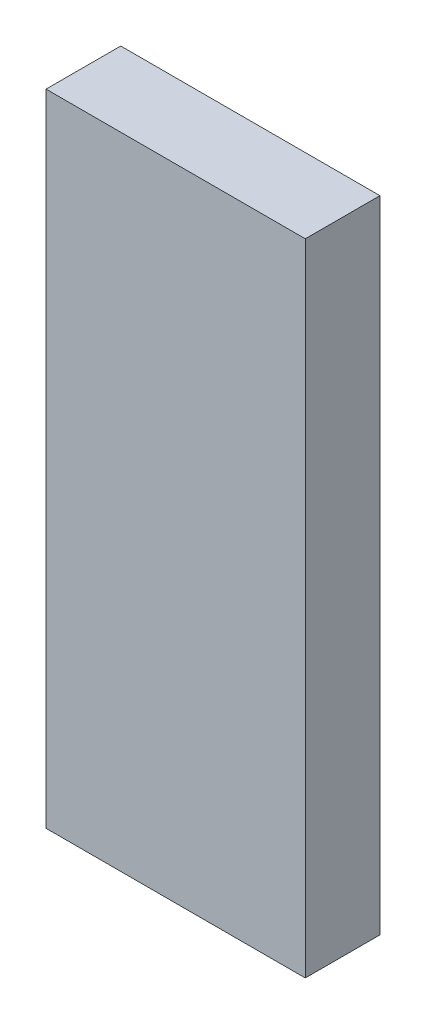
ISO-10303-21;
HEADER;
FILE_DESCRIPTION(('STEP AP214'),'2;1');
FILE_NAME('part.step','',(''),(''),'','','');
FILE_SCHEMA(('AUTOMOTIVE_DESIGN { 1 0 10303 214 1 1 1 1 }'));
ENDSEC;
DATA;
#1=APPLICATION_CONTEXT('core data for automotive mechanical design processes');
#2=APPLICATION_PROTOCOL_DEFINITION('international standard','automotive_design',2000,#1);
#3=PRODUCT_CONTEXT('',#1,'mechanical');
#4=PRODUCT('Part','Part','',(#3));
#5=PRODUCT_RELATED_PRODUCT_CATEGORY('part','',(#4));
#6=PRODUCT_DEFINITION_FORMATION('','',#4);
#7=PRODUCT_DEFINITION_CONTEXT('part definition',#1,'design');
#8=PRODUCT_DEFINITION('design','',#6,#7);
#9=PRODUCT_DEFINITION_SHAPE('','',#8);
#10=(LENGTH_UNIT() NAMED_UNIT(*) SI_UNIT(.MILLI.,.METRE.));
#11=(NAMED_UNIT(*) PLANE_ANGLE_UNIT() SI_UNIT($,.RADIAN.));
#12=(NAMED_UNIT(*) SI_UNIT($,.STERADIAN.) SOLID_ANGLE_UNIT());
#13=UNCERTAINTY_MEASURE_WITH_UNIT(LENGTH_MEASURE(1.E-05),#10,'distance_accuracy_value','');
#14=(GEOMETRIC_REPRESENTATION_CONTEXT(3) GLOBAL_UNCERTAINTY_ASSIGNED_CONTEXT((#13)) GLOBAL_UNIT_ASSIGNED_CONTEXT((#10,
#11,#12)) REPRESENTATION_CONTEXT('',''));
#15=CARTESIAN_POINT('',(0.,0.,0.));
#16=DIRECTION('',(0.,0.,1.));
#17=DIRECTION('',(1.,0.,0.));
#18=AXIS2_PLACEMENT_3D('',#15,#16,#17);
#19=CARTESIAN_POINT('',(0.62500002,1.5434945,0.35999928));
#20=DIRECTION('',(0.,0.,1.));
#21=DIRECTION('',(1.,0.,0.));
#22=AXIS2_PLACEMENT_3D('',#19,#20,#21);
#23=PLANE('',#22);
#24=DIRECTION('',(1.,0.,0.));
#25=VECTOR('',#24,1.);
#26=CARTESIAN_POINT('',(-0.62500002,1.5434945,0.35999928));
#27=LINE('',#26,#25);
#28=CARTESIAN_POINT('',(-0.62500002,1.5434945,0.35999928));
#29=VERTEX_POINT('',#28);
#30=CARTESIAN_POINT('',(0.62500002,1.5434945,0.35999928));
#31=VERTEX_POINT('',#30);
#32=EDGE_CURVE('E27',#29,#31,#27,.T.);
#33=ORIENTED_EDGE('',*,*,#32,.F.);
#34=DIRECTION('',(0.,1.,0.));
#35=VECTOR('',#34,1.);
#36=CARTESIAN_POINT('',(-0.62500002,-1.54349196,0.35999928));
#37=LINE('',#36,#35);
#38=CARTESIAN_POINT('',(-0.62500002,-1.54349196,0.35999928));
#39=VERTEX_POINT('',#38);
#40=EDGE_CURVE('E97',#39,#29,#37,.T.);
#41=ORIENTED_EDGE('',*,*,#40,.F.);
#42=DIRECTION('',(-1.,0.,0.));
#43=VECTOR('',#42,1.);
#44=CARTESIAN_POINT('',(0.62500002,-1.54349196,0.35999928));
#45=LINE('',#44,#43);
#46=CARTESIAN_POINT('',(0.62500002,-1.54349196,0.35999928));
#47=VERTEX_POINT('',#46);
#48=EDGE_CURVE('E20',#47,#39,#45,.T.);
#49=ORIENTED_EDGE('',*,*,#48,.F.);
#50=DIRECTION('',(0.,-1.,0.));
#51=VECTOR('',#50,1.);
#52=CARTESIAN_POINT('',(0.62500002,1.5434945,0.35999928));
#53=LINE('',#52,#51);
#54=EDGE_CURVE('E81',#31,#47,#53,.T.);
#55=ORIENTED_EDGE('',*,*,#54,.F.);
#56=EDGE_LOOP('',(#33,#41,#49,#55));
#57=FACE_BOUND('',#56,.T.);
#58=ADVANCED_FACE('F16',(#57),#23,.T.);
#59=CARTESIAN_POINT('',(0.62500002,1.5434945,0.));
#60=DIRECTION('',(0.,0.,1.));
#61=DIRECTION('',(1.,0.,0.));
#62=AXIS2_PLACEMENT_3D('',#59,#60,#61);
#63=PLANE('',#62);
#64=DIRECTION('',(0.,-1.,0.));
#65=VECTOR('',#64,1.);
#66=CARTESIAN_POINT('',(0.62500002,1.5434945,0.));
#67=LINE('',#66,#65);
#68=CARTESIAN_POINT('',(0.62500002,1.5434945,0.));
#69=VERTEX_POINT('',#68);
#70=CARTESIAN_POINT('',(0.62500002,-1.54349196,0.));
#71=VERTEX_POINT('',#70);
#72=EDGE_CURVE('E89',#69,#71,#67,.T.);
#73=ORIENTED_EDGE('',*,*,#72,.T.);
#74=DIRECTION('',(-1.,0.,0.));
#75=VECTOR('',#74,1.);
#76=CARTESIAN_POINT('',(0.62500002,-1.54349196,0.));
#77=LINE('',#76,#75);
#78=CARTESIAN_POINT('',(-0.62500002,-1.54349196,0.));
#79=VERTEX_POINT('',#78);
#80=EDGE_CURVE('E100',#71,#79,#77,.T.);
#81=ORIENTED_EDGE('',*,*,#80,.T.);
#82=DIRECTION('',(0.,1.,0.));
#83=VECTOR('',#82,1.);
#84=CARTESIAN_POINT('',(-0.62500002,-1.54349196,0.));
#85=LINE('',#84,#83);
#86=CARTESIAN_POINT('',(-0.62500002,1.5434945,0.));
#87=VERTEX_POINT('',#86);
#88=EDGE_CURVE('E78',#79,#87,#85,.T.);
#89=ORIENTED_EDGE('',*,*,#88,.T.);
#90=DIRECTION('',(1.,0.,0.));
#91=VECTOR('',#90,1.);
#92=CARTESIAN_POINT('',(-0.62500002,1.5434945,0.));
#93=LINE('',#92,#91);
#94=EDGE_CURVE('E10',#87,#69,#93,.T.);
#95=ORIENTED_EDGE('',*,*,#94,.T.);
#96=EDGE_LOOP('',(#73,#81,#89,#95));
#97=FACE_BOUND('',#96,.T.);
#98=ADVANCED_FACE('F115',(#97),#63,.F.);
#99=CARTESIAN_POINT('',(-0.62500002,1.5434945,0.));
#100=DIRECTION('',(0.,1.,0.));
#101=DIRECTION('',(1.,0.,0.));
#102=AXIS2_PLACEMENT_3D('',#99,#100,#101);
#103=PLANE('',#102);
#104=DIRECTION('',(0.,0.,1.));
#105=VECTOR('',#104,1.);
#106=CARTESIAN_POINT('',(-0.62500002,1.5434945,0.));
#107=LINE('',#106,#105);
#108=EDGE_CURVE('E74',#87,#29,#107,.T.);
#109=ORIENTED_EDGE('',*,*,#108,.T.);
#110=ORIENTED_EDGE('',*,*,#32,.T.);
#111=DIRECTION('',(0.,0.,1.));
#112=VECTOR('',#111,1.);
#113=CARTESIAN_POINT('',(0.62500002,1.5434945,0.));
#114=LINE('',#113,#112);
#115=EDGE_CURVE('E72',#69,#31,#114,.T.);
#116=ORIENTED_EDGE('',*,*,#115,.F.);
#117=ORIENTED_EDGE('',*,*,#94,.F.);
#118=EDGE_LOOP('',(#109,#110,#116,#117));
#119=FACE_BOUND('',#118,.T.);
#120=ADVANCED_FACE('F70',(#119),#103,.T.);
#121=CARTESIAN_POINT('',(-0.62500002,-1.54349196,0.));
#122=DIRECTION('',(-1.,0.,0.));
#123=DIRECTION('',(0.,0.,1.));
#124=AXIS2_PLACEMENT_3D('',#121,#122,#123);
#125=PLANE('',#124);
#126=DIRECTION('',(0.,0.,1.));
#127=VECTOR('',#126,1.);
#128=CARTESIAN_POINT('',(-0.62500002,-1.54349196,0.));
#129=LINE('',#128,#127);
#130=EDGE_CURVE('E104',#79,#39,#129,.T.);
#131=ORIENTED_EDGE('',*,*,#130,.T.);
#132=ORIENTED_EDGE('',*,*,#40,.T.);
#133=ORIENTED_EDGE('',*,*,#108,.F.);
#134=ORIENTED_EDGE('',*,*,#88,.F.);
#135=EDGE_LOOP('',(#131,#132,#133,#134));
#136=FACE_BOUND('',#135,.T.);
#137=ADVANCED_FACE('F118',(#136),#125,.T.);
#138=CARTESIAN_POINT('',(0.62500002,-1.54349196,0.));
#139=DIRECTION('',(0.,-1.,0.));
#140=DIRECTION('',(0.,0.,-1.));
#141=AXIS2_PLACEMENT_3D('',#138,#139,#140);
#142=PLANE('',#141);
#143=DIRECTION('',(0.,0.,1.));
#144=VECTOR('',#143,1.);
#145=CARTESIAN_POINT('',(0.62500002,-1.54349196,0.));
#146=LINE('',#145,#144);
#147=EDGE_CURVE('E87',#71,#47,#146,.T.);
#148=ORIENTED_EDGE('',*,*,#147,.T.);
#149=ORIENTED_EDGE('',*,*,#48,.T.);
#150=ORIENTED_EDGE('',*,*,#130,.F.);
#151=ORIENTED_EDGE('',*,*,#80,.F.);
#152=EDGE_LOOP('',(#148,#149,#150,#151));
#153=FACE_BOUND('',#152,.T.);
#154=ADVANCED_FACE('F120',(#153),#142,.T.);
#155=CARTESIAN_POINT('',(0.62500002,1.5434945,0.));
#156=DIRECTION('',(1.,0.,0.));
#157=DIRECTION('',(0.,1.,0.));
#158=AXIS2_PLACEMENT_3D('',#155,#156,#157);
#159=PLANE('',#158);
#160=ORIENTED_EDGE('',*,*,#115,.T.);
#161=ORIENTED_EDGE('',*,*,#54,.T.);
#162=ORIENTED_EDGE('',*,*,#147,.F.);
#163=ORIENTED_EDGE('',*,*,#72,.F.);
#164=EDGE_LOOP('',(#160,#161,#162,#163));
#165=FACE_BOUND('',#164,.T.);
#166=ADVANCED_FACE('F18',(#165),#159,.T.);
#167=CLOSED_SHELL('',(#58,#98,#120,#137,#154,#166));
#168=MANIFOLD_SOLID_BREP('B1',#167);
#169=ADVANCED_BREP_SHAPE_REPRESENTATION('',(#18,#168),#14);
#170=SHAPE_DEFINITION_REPRESENTATION(#9,#169);
ENDSEC;
END-ISO-10303-21;
